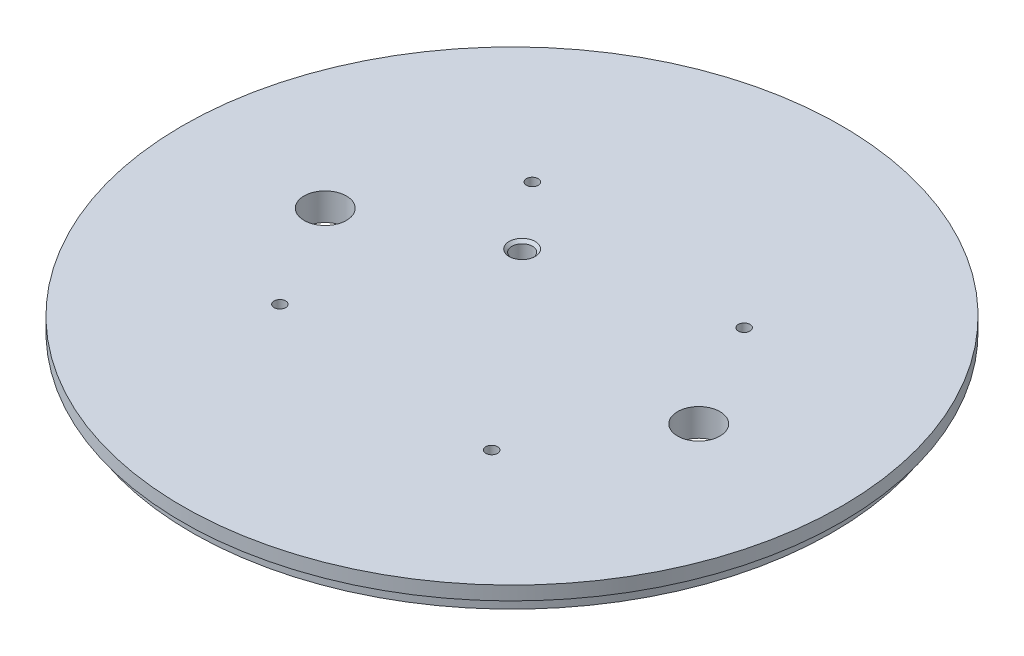
ISO-10303-21;
HEADER;
FILE_DESCRIPTION(('STEP AP214'),'2;1');
FILE_NAME('part.step','',(''),(''),'','','');
FILE_SCHEMA(('AUTOMOTIVE_DESIGN { 1 0 10303 214 1 1 1 1 }'));
ENDSEC;
DATA;
#1=APPLICATION_CONTEXT('core data for automotive mechanical design processes');
#2=APPLICATION_PROTOCOL_DEFINITION('international standard','automotive_design',2000,#1);
#3=PRODUCT_CONTEXT('',#1,'mechanical');
#4=PRODUCT('Part','Part','',(#3));
#5=PRODUCT_RELATED_PRODUCT_CATEGORY('part','',(#4));
#6=PRODUCT_DEFINITION_FORMATION('','',#4);
#7=PRODUCT_DEFINITION_CONTEXT('part definition',#1,'design');
#8=PRODUCT_DEFINITION('design','',#6,#7);
#9=PRODUCT_DEFINITION_SHAPE('','',#8);
#10=(LENGTH_UNIT() NAMED_UNIT(*) SI_UNIT(.MILLI.,.METRE.));
#11=(NAMED_UNIT(*) PLANE_ANGLE_UNIT() SI_UNIT($,.RADIAN.));
#12=(NAMED_UNIT(*) SI_UNIT($,.STERADIAN.) SOLID_ANGLE_UNIT());
#13=UNCERTAINTY_MEASURE_WITH_UNIT(LENGTH_MEASURE(1.E-05),#10,'distance_accuracy_value','');
#14=(GEOMETRIC_REPRESENTATION_CONTEXT(3) GLOBAL_UNCERTAINTY_ASSIGNED_CONTEXT((#13)) GLOBAL_UNIT_ASSIGNED_CONTEXT((#10,
#11,#12)) REPRESENTATION_CONTEXT('',''));
#15=CARTESIAN_POINT('',(0.,0.,0.));
#16=DIRECTION('',(0.,0.,1.));
#17=DIRECTION('',(1.,0.,0.));
#18=AXIS2_PLACEMENT_3D('',#15,#16,#17);
#19=CARTESIAN_POINT('',(0.,0.,0.));
#20=DIRECTION('',(0.,1.,0.));
#21=DIRECTION('',(-0.642787609686541,0.,0.766044443118977));
#22=AXIS2_PLACEMENT_3D('',#19,#20,#21);
#23=PLANE('',#22);
#24=CARTESIAN_POINT('',(2.39391839684799E-13,0.,-34.798));
#25=DIRECTION('',(0.,1.,0.));
#26=DIRECTION('',(0.642787609686535,0.,0.766044443118982));
#27=AXIS2_PLACEMENT_3D('',#24,#25,#26);
#28=CIRCLE('',#27,3.23850000000001);
#29=CARTESIAN_POINT('',(3.23850000000025,0.,-34.798));
#30=VERTEX_POINT('',#29);
#31=CARTESIAN_POINT('',(-3.23849999999977,0.,-34.798));
#32=VERTEX_POINT('',#31);
#33=EDGE_CURVE('E54',#30,#32,#28,.T.);
#34=ORIENTED_EDGE('',*,*,#33,.T.);
#35=DIRECTION('',(0.,0.,1.));
#36=VECTOR('',#35,1.);
#37=CARTESIAN_POINT('',(-3.23850000000008,0.,0.));
#38=LINE('',#37,#36);
#39=CARTESIAN_POINT('',(-3.23849999999996,0.,-13.97));
#40=VERTEX_POINT('',#39);
#41=EDGE_CURVE('E120',#32,#40,#38,.T.);
#42=ORIENTED_EDGE('',*,*,#41,.T.);
#43=CARTESIAN_POINT('',(0.,0.,-13.97));
#44=DIRECTION('',(0.,1.,0.));
#45=DIRECTION('',(0.642787609686535,0.,0.766044443118982));
#46=AXIS2_PLACEMENT_3D('',#43,#44,#45);
#47=CIRCLE('',#46,3.23850000000003);
#48=CARTESIAN_POINT('',(3.23850000000009,0.,-13.97));
#49=VERTEX_POINT('',#48);
#50=EDGE_CURVE('E134',#40,#49,#47,.T.);
#51=ORIENTED_EDGE('',*,*,#50,.T.);
#52=DIRECTION('',(0.,0.,1.));
#53=VECTOR('',#52,1.);
#54=CARTESIAN_POINT('',(3.2385,0.,0.));
#55=LINE('',#54,#53);
#56=EDGE_CURVE('E131',#30,#49,#55,.T.);
#57=ORIENTED_EDGE('',*,*,#56,.F.);
#58=EDGE_LOOP('',(#34,#42,#51,#57));
#59=FACE_BOUND('',#58,.T.);
#60=DIRECTION('',(0.,0.,-1.));
#61=VECTOR('',#60,1.);
#62=CARTESIAN_POINT('',(-3.23850000000008,0.,0.));
#63=LINE('',#62,#61);
#64=CARTESIAN_POINT('',(-3.23850000000001,0.,34.798));
#65=VERTEX_POINT('',#64);
#66=CARTESIAN_POINT('',(-3.23850000000005,0.,13.97));
#67=VERTEX_POINT('',#66);
#68=EDGE_CURVE('E158',#65,#67,#63,.T.);
#69=ORIENTED_EDGE('',*,*,#68,.F.);
#70=CARTESIAN_POINT('',(0.,0.,34.798));
#71=DIRECTION('',(0.,-1.,0.));
#72=DIRECTION('',(0.642787609686541,0.,-0.766044443118977));
#73=AXIS2_PLACEMENT_3D('',#70,#71,#72);
#74=CIRCLE('',#73,3.23850000000001);
#75=CARTESIAN_POINT('',(3.23850000000001,0.,34.798));
#76=VERTEX_POINT('',#75);
#77=EDGE_CURVE('E62',#76,#65,#74,.T.);
#78=ORIENTED_EDGE('',*,*,#77,.F.);
#79=DIRECTION('',(0.,0.,-1.));
#80=VECTOR('',#79,1.);
#81=CARTESIAN_POINT('',(3.2385,0.,0.));
#82=LINE('',#81,#80);
#83=CARTESIAN_POINT('',(3.2385,0.,13.97));
#84=VERTEX_POINT('',#83);
#85=EDGE_CURVE('E148',#76,#84,#82,.T.);
#86=ORIENTED_EDGE('',*,*,#85,.T.);
#87=CARTESIAN_POINT('',(0.,0.,13.97));
#88=DIRECTION('',(0.,-1.,0.));
#89=DIRECTION('',(0.642787609686541,0.,-0.766044443118977));
#90=AXIS2_PLACEMENT_3D('',#87,#88,#89);
#91=CIRCLE('',#90,3.23850000000003);
#92=EDGE_CURVE('E161',#67,#84,#91,.T.);
#93=ORIENTED_EDGE('',*,*,#92,.F.);
#94=EDGE_LOOP('',(#69,#78,#86,#93));
#95=FACE_BOUND('',#94,.T.);
#96=CARTESIAN_POINT('',(-12.2451039645285,0.,-14.5931466414166));
#97=DIRECTION('',(0.,-1.,0.));
#98=DIRECTION('',(0.642787609686541,0.,-0.766044443118977));
#99=AXIS2_PLACEMENT_3D('',#96,#97,#98);
#100=CIRCLE('',#99,3.01625);
#101=CARTESIAN_POINT('',(-10.3062958368115,0.,-16.9037281929742));
#102=VERTEX_POINT('',#101);
#103=EDGE_CURVE('E176',#102,#102,#100,.T.);
#104=ORIENTED_EDGE('',*,*,#103,.F.);
#105=EDGE_LOOP('',(#104));
#106=FACE_BOUND('',#105,.T.);
#107=CARTESIAN_POINT('',(43.18,0.,1.42247325030098E-13));
#108=DIRECTION('',(0.,-1.,0.));
#109=DIRECTION('',(0.642787609686541,0.,-0.766044443118977));
#110=AXIS2_PLACEMENT_3D('',#107,#108,#109);
#111=CIRCLE('',#110,4.9022);
#112=CARTESIAN_POINT('',(46.3310734202054,0.,-3.7553030690577));
#113=VERTEX_POINT('',#112);
#114=EDGE_CURVE('E185',#113,#113,#111,.T.);
#115=ORIENTED_EDGE('',*,*,#114,.F.);
#116=EDGE_LOOP('',(#115));
#117=FACE_BOUND('',#116,.T.);
#118=CARTESIAN_POINT('',(-43.18,0.,-1.42247325030098E-13));
#119=DIRECTION('',(0.,-1.,0.));
#120=DIRECTION('',(0.642787609686541,0.,-0.766044443118977));
#121=AXIS2_PLACEMENT_3D('',#118,#119,#120);
#122=CIRCLE('',#121,4.9022);
#123=CARTESIAN_POINT('',(-40.0289265797946,0.,-3.75530306905799));
#124=VERTEX_POINT('',#123);
#125=EDGE_CURVE('E191',#124,#124,#122,.T.);
#126=ORIENTED_EDGE('',*,*,#125,.F.);
#127=EDGE_LOOP('',(#126));
#128=FACE_BOUND('',#127,.T.);
#129=CARTESIAN_POINT('',(29.1862932828329,0.,-24.4902079290574));
#130=DIRECTION('',(0.,-1.,0.));
#131=DIRECTION('',(0.642787609686541,0.,-0.766044443118977));
#132=AXIS2_PLACEMENT_3D('',#129,#130,#131);
#133=CIRCLE('',#132,1.35255);
#134=CARTESIAN_POINT('',(30.0556956643144,0.,-25.526321340598));
#135=VERTEX_POINT('',#134);
#136=EDGE_CURVE('E197',#135,#135,#133,.T.);
#137=ORIENTED_EDGE('',*,*,#136,.F.);
#138=EDGE_LOOP('',(#137));
#139=FACE_BOUND('',#138,.T.);
#140=CARTESIAN_POINT('',(24.4902079290571,0.,29.1862932828331));
#141=DIRECTION('',(0.,-1.,0.));
#142=DIRECTION('',(0.642787609686541,0.,-0.766044443118977));
#143=AXIS2_PLACEMENT_3D('',#140,#141,#142);
#144=CIRCLE('',#143,1.35255);
#145=CARTESIAN_POINT('',(25.3596103105386,0.,28.1501798712926));
#146=VERTEX_POINT('',#145);
#147=EDGE_CURVE('E203',#146,#146,#144,.T.);
#148=ORIENTED_EDGE('',*,*,#147,.F.);
#149=EDGE_LOOP('',(#148));
#150=FACE_BOUND('',#149,.T.);
#151=CARTESIAN_POINT('',(-24.4902079290571,0.,-29.1862932828331));
#152=DIRECTION('',(0.,-1.,0.));
#153=DIRECTION('',(0.642787609686541,0.,-0.766044443118977));
#154=AXIS2_PLACEMENT_3D('',#151,#152,#153);
#155=CIRCLE('',#154,1.35255);
#156=CARTESIAN_POINT('',(-23.6208055475756,0.,-30.2224066943737));
#157=VERTEX_POINT('',#156);
#158=EDGE_CURVE('E215',#157,#157,#155,.T.);
#159=ORIENTED_EDGE('',*,*,#158,.F.);
#160=EDGE_LOOP('',(#159));
#161=FACE_BOUND('',#160,.T.);
#162=CARTESIAN_POINT('',(-29.186293282833,0.,24.4902079290572));
#163=DIRECTION('',(0.,-1.,0.));
#164=DIRECTION('',(0.642787609686541,0.,-0.766044443118977));
#165=AXIS2_PLACEMENT_3D('',#162,#163,#164);
#166=CIRCLE('',#165,1.35255);
#167=CARTESIAN_POINT('',(-28.3168909013515,0.,23.4540945175166));
#168=VERTEX_POINT('',#167);
#169=EDGE_CURVE('E209',#168,#168,#166,.T.);
#170=ORIENTED_EDGE('',*,*,#169,.F.);
#171=EDGE_LOOP('',(#170));
#172=FACE_BOUND('',#171,.T.);
#173=CARTESIAN_POINT('',(0.,0.,0.));
#174=DIRECTION('',(0.,-1.,0.));
#175=DIRECTION('',(0.642787609686541,0.,-0.766044443118977));
#176=AXIS2_PLACEMENT_3D('',#173,#174,#175);
#177=CIRCLE('',#176,74.041);
#178=CARTESIAN_POINT('',(47.5926374088011,0.,-56.7186966129722));
#179=VERTEX_POINT('',#178);
#180=EDGE_CURVE('E237',#179,#179,#177,.T.);
#181=ORIENTED_EDGE('',*,*,#180,.T.);
#182=EDGE_LOOP('',(#181));
#183=FACE_BOUND('',#182,.T.);
#184=ADVANCED_FACE('F39',(#59,#95,#106,#117,#128,#139,#150,#161,#172,#183),#23,.F.);
#185=CARTESIAN_POINT('',(0.,6.35,0.));
#186=DIRECTION('',(0.,-1.,0.));
#187=DIRECTION('',(0.642787609686541,0.,-0.766044443118977));
#188=AXIS2_PLACEMENT_3D('',#185,#186,#187);
#189=CYLINDRICAL_SURFACE('',#188,76.2);
#190=CARTESIAN_POINT('',(0.,6.35,0.));
#191=DIRECTION('',(0.,1.,0.));
#192=DIRECTION('',(-0.642787609686541,0.,0.766044443118977));
#193=AXIS2_PLACEMENT_3D('',#190,#191,#192);
#194=CIRCLE('',#193,76.2);
#195=CARTESIAN_POINT('',(-48.9804158581144,6.35,58.3725865656661));
#196=VERTEX_POINT('',#195);
#197=EDGE_CURVE('E11',#196,#196,#194,.T.);
#198=ORIENTED_EDGE('',*,*,#197,.F.);
#199=EDGE_LOOP('',(#198));
#200=FACE_BOUND('',#199,.T.);
#201=CARTESIAN_POINT('',(0.,3.175,0.));
#202=DIRECTION('',(0.,-1.,0.));
#203=DIRECTION('',(0.642787609686541,0.,-0.766044443118977));
#204=AXIS2_PLACEMENT_3D('',#201,#202,#203);
#205=CIRCLE('',#204,76.2);
#206=CARTESIAN_POINT('',(48.9804158581144,3.175,-58.3725865656661));
#207=VERTEX_POINT('',#206);
#208=EDGE_CURVE('E132',#207,#207,#205,.T.);
#209=ORIENTED_EDGE('',*,*,#208,.F.);
#210=EDGE_LOOP('',(#209));
#211=FACE_BOUND('',#210,.T.);
#212=ADVANCED_FACE('F41',(#200,#211),#189,.T.);
#213=CARTESIAN_POINT('',(0.,6.35,0.));
#214=DIRECTION('',(0.,1.,0.));
#215=DIRECTION('',(-0.642787609686541,0.,0.766044443118977));
#216=AXIS2_PLACEMENT_3D('',#213,#214,#215);
#217=PLANE('',#216);
#218=CARTESIAN_POINT('',(-12.2451039645285,6.34999999999999,-14.5931466414166));
#219=DIRECTION('',(0.,-1.,0.));
#220=DIRECTION('',(0.642787609686541,0.,-0.766044443118977));
#221=AXIS2_PLACEMENT_3D('',#218,#219,#220);
#222=CIRCLE('',#221,3.01625);
#223=CARTESIAN_POINT('',(-10.3062958368115,6.34999999999999,-16.9037281929742));
#224=VERTEX_POINT('',#223);
#225=EDGE_CURVE('E168',#224,#224,#222,.T.);
#226=ORIENTED_EDGE('',*,*,#225,.T.);
#227=EDGE_LOOP('',(#226));
#228=FACE_BOUND('',#227,.T.);
#229=CARTESIAN_POINT('',(43.18,6.35,1.42247325030098E-13));
#230=DIRECTION('',(0.,-1.,0.));
#231=DIRECTION('',(0.642787609686541,0.,-0.766044443118977));
#232=AXIS2_PLACEMENT_3D('',#229,#230,#231);
#233=CIRCLE('',#232,4.9022);
#234=CARTESIAN_POINT('',(46.3310734202054,6.35,-3.7553030690577));
#235=VERTEX_POINT('',#234);
#236=EDGE_CURVE('E188',#235,#235,#233,.T.);
#237=ORIENTED_EDGE('',*,*,#236,.T.);
#238=EDGE_LOOP('',(#237));
#239=FACE_BOUND('',#238,.T.);
#240=CARTESIAN_POINT('',(-43.18,6.35,-1.42247325030098E-13));
#241=DIRECTION('',(0.,-1.,0.));
#242=DIRECTION('',(0.642787609686541,0.,-0.766044443118977));
#243=AXIS2_PLACEMENT_3D('',#240,#241,#242);
#244=CIRCLE('',#243,4.9022);
#245=CARTESIAN_POINT('',(-40.0289265797946,6.35,-3.75530306905799));
#246=VERTEX_POINT('',#245);
#247=EDGE_CURVE('E194',#246,#246,#244,.T.);
#248=ORIENTED_EDGE('',*,*,#247,.T.);
#249=EDGE_LOOP('',(#248));
#250=FACE_BOUND('',#249,.T.);
#251=CARTESIAN_POINT('',(29.1862932828329,6.35,-24.4902079290574));
#252=DIRECTION('',(0.,-1.,0.));
#253=DIRECTION('',(0.642787609686541,0.,-0.766044443118977));
#254=AXIS2_PLACEMENT_3D('',#251,#252,#253);
#255=CIRCLE('',#254,1.35255);
#256=CARTESIAN_POINT('',(30.0556956643144,6.35,-25.526321340598));
#257=VERTEX_POINT('',#256);
#258=EDGE_CURVE('E200',#257,#257,#255,.T.);
#259=ORIENTED_EDGE('',*,*,#258,.T.);
#260=EDGE_LOOP('',(#259));
#261=FACE_BOUND('',#260,.T.);
#262=CARTESIAN_POINT('',(24.4902079290571,6.35,29.1862932828331));
#263=DIRECTION('',(0.,-1.,0.));
#264=DIRECTION('',(0.642787609686541,0.,-0.766044443118977));
#265=AXIS2_PLACEMENT_3D('',#262,#263,#264);
#266=CIRCLE('',#265,1.35255);
#267=CARTESIAN_POINT('',(25.3596103105386,6.35,28.1501798712926));
#268=VERTEX_POINT('',#267);
#269=EDGE_CURVE('E206',#268,#268,#266,.T.);
#270=ORIENTED_EDGE('',*,*,#269,.T.);
#271=EDGE_LOOP('',(#270));
#272=FACE_BOUND('',#271,.T.);
#273=CARTESIAN_POINT('',(-29.186293282833,6.35,24.4902079290572));
#274=DIRECTION('',(0.,-1.,0.));
#275=DIRECTION('',(0.642787609686541,0.,-0.766044443118977));
#276=AXIS2_PLACEMENT_3D('',#273,#274,#275);
#277=CIRCLE('',#276,1.35255);
#278=CARTESIAN_POINT('',(-28.3168909013515,6.35,23.4540945175166));
#279=VERTEX_POINT('',#278);
#280=EDGE_CURVE('E212',#279,#279,#277,.T.);
#281=ORIENTED_EDGE('',*,*,#280,.T.);
#282=EDGE_LOOP('',(#281));
#283=FACE_BOUND('',#282,.T.);
#284=CARTESIAN_POINT('',(-24.4902079290571,6.35,-29.1862932828331));
#285=DIRECTION('',(0.,-1.,0.));
#286=DIRECTION('',(0.642787609686541,0.,-0.766044443118977));
#287=AXIS2_PLACEMENT_3D('',#284,#285,#286);
#288=CIRCLE('',#287,1.35255);
#289=CARTESIAN_POINT('',(-23.6208055475756,6.35,-30.2224066943737));
#290=VERTEX_POINT('',#289);
#291=EDGE_CURVE('E47',#290,#290,#288,.T.);
#292=ORIENTED_EDGE('',*,*,#291,.T.);
#293=EDGE_LOOP('',(#292));
#294=FACE_BOUND('',#293,.T.);
#295=ORIENTED_EDGE('',*,*,#197,.T.);
#296=EDGE_LOOP('',(#295));
#297=FACE_BOUND('',#296,.T.);
#298=ADVANCED_FACE('F220',(#228,#239,#250,#261,#272,#283,#294,#297),#217,.T.);
#299=CARTESIAN_POINT('',(-24.4902079290571,0.,-29.1862932828331));
#300=DIRECTION('',(0.,-1.,0.));
#301=DIRECTION('',(0.642787609686541,0.,-0.766044443118977));
#302=AXIS2_PLACEMENT_3D('',#299,#300,#301);
#303=CYLINDRICAL_SURFACE('',#302,1.35255);
#304=ORIENTED_EDGE('',*,*,#291,.F.);
#305=EDGE_LOOP('',(#304));
#306=FACE_BOUND('',#305,.T.);
#307=ORIENTED_EDGE('',*,*,#158,.T.);
#308=EDGE_LOOP('',(#307));
#309=FACE_BOUND('',#308,.T.);
#310=ADVANCED_FACE('F223',(#306,#309),#303,.F.);
#311=CARTESIAN_POINT('',(-29.186293282833,0.,24.4902079290572));
#312=DIRECTION('',(0.,-1.,0.));
#313=DIRECTION('',(0.642787609686541,0.,-0.766044443118977));
#314=AXIS2_PLACEMENT_3D('',#311,#312,#313);
#315=CYLINDRICAL_SURFACE('',#314,1.35255);
#316=ORIENTED_EDGE('',*,*,#280,.F.);
#317=EDGE_LOOP('',(#316));
#318=FACE_BOUND('',#317,.T.);
#319=ORIENTED_EDGE('',*,*,#169,.T.);
#320=EDGE_LOOP('',(#319));
#321=FACE_BOUND('',#320,.T.);
#322=ADVANCED_FACE('F226',(#318,#321),#315,.F.);
#323=CARTESIAN_POINT('',(24.4902079290571,0.,29.1862932828331));
#324=DIRECTION('',(0.,-1.,0.));
#325=DIRECTION('',(0.642787609686541,0.,-0.766044443118977));
#326=AXIS2_PLACEMENT_3D('',#323,#324,#325);
#327=CYLINDRICAL_SURFACE('',#326,1.35255);
#328=ORIENTED_EDGE('',*,*,#269,.F.);
#329=EDGE_LOOP('',(#328));
#330=FACE_BOUND('',#329,.T.);
#331=ORIENTED_EDGE('',*,*,#147,.T.);
#332=EDGE_LOOP('',(#331));
#333=FACE_BOUND('',#332,.T.);
#334=ADVANCED_FACE('F262',(#330,#333),#327,.F.);
#335=CARTESIAN_POINT('',(29.1862932828329,0.,-24.4902079290574));
#336=DIRECTION('',(0.,-1.,0.));
#337=DIRECTION('',(0.642787609686541,0.,-0.766044443118977));
#338=AXIS2_PLACEMENT_3D('',#335,#336,#337);
#339=CYLINDRICAL_SURFACE('',#338,1.35255);
#340=ORIENTED_EDGE('',*,*,#258,.F.);
#341=EDGE_LOOP('',(#340));
#342=FACE_BOUND('',#341,.T.);
#343=ORIENTED_EDGE('',*,*,#136,.T.);
#344=EDGE_LOOP('',(#343));
#345=FACE_BOUND('',#344,.T.);
#346=ADVANCED_FACE('F266',(#342,#345),#339,.F.);
#347=CARTESIAN_POINT('',(-43.18,0.,-1.42247325030098E-13));
#348=DIRECTION('',(0.,-1.,0.));
#349=DIRECTION('',(0.642787609686541,0.,-0.766044443118977));
#350=AXIS2_PLACEMENT_3D('',#347,#348,#349);
#351=CYLINDRICAL_SURFACE('',#350,4.9022);
#352=ORIENTED_EDGE('',*,*,#247,.F.);
#353=EDGE_LOOP('',(#352));
#354=FACE_BOUND('',#353,.T.);
#355=ORIENTED_EDGE('',*,*,#125,.T.);
#356=EDGE_LOOP('',(#355));
#357=FACE_BOUND('',#356,.T.);
#358=ADVANCED_FACE('F270',(#354,#357),#351,.F.);
#359=CARTESIAN_POINT('',(43.18,0.,1.42247325030098E-13));
#360=DIRECTION('',(0.,-1.,0.));
#361=DIRECTION('',(0.642787609686541,0.,-0.766044443118977));
#362=AXIS2_PLACEMENT_3D('',#359,#360,#361);
#363=CYLINDRICAL_SURFACE('',#362,4.9022);
#364=ORIENTED_EDGE('',*,*,#236,.F.);
#365=EDGE_LOOP('',(#364));
#366=FACE_BOUND('',#365,.T.);
#367=ORIENTED_EDGE('',*,*,#114,.T.);
#368=EDGE_LOOP('',(#367));
#369=FACE_BOUND('',#368,.T.);
#370=ADVANCED_FACE('F274',(#366,#369),#363,.F.);
#371=CARTESIAN_POINT('',(-12.2451039645285,5.715,-14.5931466414166));
#372=DIRECTION('',(0.,1.,0.));
#373=DIRECTION('',(-0.642787609686541,0.,0.766044443118977));
#374=AXIS2_PLACEMENT_3D('',#371,#372,#373);
#375=CONICAL_SURFACE('',#374,2.38124999999999,0.785398163397459);
#376=ORIENTED_EDGE('',*,*,#225,.F.);
#377=EDGE_LOOP('',(#376));
#378=FACE_BOUND('',#377,.T.);
#379=CARTESIAN_POINT('',(-12.2451039645285,5.715,-14.5931466414166));
#380=DIRECTION('',(0.,-1.,0.));
#381=DIRECTION('',(0.642787609686541,0.,-0.766044443118977));
#382=AXIS2_PLACEMENT_3D('',#379,#380,#381);
#383=CIRCLE('',#382,2.38124999999999);
#384=CARTESIAN_POINT('',(-10.7144659689625,5.715,-16.4172899715936));
#385=VERTEX_POINT('',#384);
#386=EDGE_CURVE('E182',#385,#385,#383,.T.);
#387=ORIENTED_EDGE('',*,*,#386,.T.);
#388=EDGE_LOOP('',(#387));
#389=FACE_BOUND('',#388,.T.);
#390=ADVANCED_FACE('F278',(#378,#389),#375,.F.);
#391=CARTESIAN_POINT('',(-12.2451039645285,0.,-14.5931466414166));
#392=DIRECTION('',(0.,-1.,0.));
#393=DIRECTION('',(0.642787609686541,0.,-0.766044443118977));
#394=AXIS2_PLACEMENT_3D('',#391,#392,#393);
#395=CYLINDRICAL_SURFACE('',#394,2.38124999999999);
#396=ORIENTED_EDGE('',*,*,#386,.F.);
#397=EDGE_LOOP('',(#396));
#398=FACE_BOUND('',#397,.T.);
#399=CARTESIAN_POINT('',(-12.2451039645285,0.635000000000011,-14.5931466414166));
#400=DIRECTION('',(0.,-1.,0.));
#401=DIRECTION('',(0.642787609686541,0.,-0.766044443118977));
#402=AXIS2_PLACEMENT_3D('',#399,#400,#401);
#403=CIRCLE('',#402,2.38124999999999);
#404=CARTESIAN_POINT('',(-10.7144659689625,0.635000000000011,-16.4172899715936));
#405=VERTEX_POINT('',#404);
#406=EDGE_CURVE('E179',#405,#405,#403,.T.);
#407=ORIENTED_EDGE('',*,*,#406,.T.);
#408=EDGE_LOOP('',(#407));
#409=FACE_BOUND('',#408,.T.);
#410=ADVANCED_FACE('F282',(#398,#409),#395,.F.);
#411=CARTESIAN_POINT('',(-12.2451039645285,0.,-14.5931466414166));
#412=DIRECTION('',(0.,-1.,0.));
#413=DIRECTION('',(0.642787609686541,0.,-0.766044443118977));
#414=AXIS2_PLACEMENT_3D('',#411,#412,#413);
#415=CONICAL_SURFACE('',#414,3.01625,0.78539816339745);
#416=ORIENTED_EDGE('',*,*,#406,.F.);
#417=EDGE_LOOP('',(#416));
#418=FACE_BOUND('',#417,.T.);
#419=ORIENTED_EDGE('',*,*,#103,.T.);
#420=EDGE_LOOP('',(#419));
#421=FACE_BOUND('',#420,.T.);
#422=ADVANCED_FACE('F286',(#418,#421),#415,.F.);
#423=CARTESIAN_POINT('',(0.,3.175,34.798));
#424=DIRECTION('',(0.,-1.,0.));
#425=DIRECTION('',(0.642787609686541,0.,-0.766044443118977));
#426=AXIS2_PLACEMENT_3D('',#423,#424,#425);
#427=CYLINDRICAL_SURFACE('',#426,3.23850000000001);
#428=ORIENTED_EDGE('',*,*,#77,.T.);
#429=DIRECTION('',(0.,-1.,0.));
#430=VECTOR('',#429,1.);
#431=CARTESIAN_POINT('',(-3.2385,3.175,34.798));
#432=LINE('',#431,#430);
#433=CARTESIAN_POINT('',(-3.2385,3.175,34.798));
#434=VERTEX_POINT('',#433);
#435=EDGE_CURVE('E156',#434,#65,#432,.T.);
#436=ORIENTED_EDGE('',*,*,#435,.F.);
#437=CARTESIAN_POINT('',(0.,3.175,34.798));
#438=DIRECTION('',(0.,-1.,0.));
#439=DIRECTION('',(0.642787609686541,0.,-0.766044443118977));
#440=AXIS2_PLACEMENT_3D('',#437,#438,#439);
#441=CIRCLE('',#440,3.23850000000001);
#442=CARTESIAN_POINT('',(3.23850000000001,3.175,34.798));
#443=VERTEX_POINT('',#442);
#444=EDGE_CURVE('E144',#443,#434,#441,.T.);
#445=ORIENTED_EDGE('',*,*,#444,.F.);
#446=DIRECTION('',(0.,-1.,0.));
#447=VECTOR('',#446,1.);
#448=CARTESIAN_POINT('',(3.23850000000001,3.175,34.798));
#449=LINE('',#448,#447);
#450=EDGE_CURVE('E166',#443,#76,#449,.T.);
#451=ORIENTED_EDGE('',*,*,#450,.T.);
#452=EDGE_LOOP('',(#428,#436,#445,#451));
#453=FACE_BOUND('',#452,.T.);
#454=ADVANCED_FACE('F290',(#453),#427,.F.);
#455=CARTESIAN_POINT('',(3.2385,3.175,0.));
#456=DIRECTION('',(-1.,0.,0.));
#457=DIRECTION('',(0.,0.,1.));
#458=AXIS2_PLACEMENT_3D('',#455,#456,#457);
#459=PLANE('',#458);
#460=ORIENTED_EDGE('',*,*,#85,.F.);
#461=ORIENTED_EDGE('',*,*,#450,.F.);
#462=DIRECTION('',(0.,0.,-1.));
#463=VECTOR('',#462,1.);
#464=CARTESIAN_POINT('',(3.2385,3.175,0.));
#465=LINE('',#464,#463);
#466=CARTESIAN_POINT('',(3.2385,3.175,13.97));
#467=VERTEX_POINT('',#466);
#468=EDGE_CURVE('E154',#443,#467,#465,.T.);
#469=ORIENTED_EDGE('',*,*,#468,.T.);
#470=DIRECTION('',(0.,-1.,0.));
#471=VECTOR('',#470,1.);
#472=CARTESIAN_POINT('',(3.2385,3.175,13.97));
#473=LINE('',#472,#471);
#474=EDGE_CURVE('E169',#467,#84,#473,.T.);
#475=ORIENTED_EDGE('',*,*,#474,.T.);
#476=EDGE_LOOP('',(#460,#461,#469,#475));
#477=FACE_BOUND('',#476,.T.);
#478=ADVANCED_FACE('F294',(#477),#459,.T.);
#479=CARTESIAN_POINT('',(0.,3.175,13.97));
#480=DIRECTION('',(0.,-1.,0.));
#481=DIRECTION('',(0.642787609686541,0.,-0.766044443118977));
#482=AXIS2_PLACEMENT_3D('',#479,#480,#481);
#483=CYLINDRICAL_SURFACE('',#482,3.23850000000003);
#484=ORIENTED_EDGE('',*,*,#92,.T.);
#485=ORIENTED_EDGE('',*,*,#474,.F.);
#486=CARTESIAN_POINT('',(0.,3.175,13.97));
#487=DIRECTION('',(0.,-1.,0.));
#488=DIRECTION('',(0.642787609686541,0.,-0.766044443118977));
#489=AXIS2_PLACEMENT_3D('',#486,#487,#488);
#490=CIRCLE('',#489,3.23850000000003);
#491=CARTESIAN_POINT('',(-3.23850000000005,3.175,13.97));
#492=VERTEX_POINT('',#491);
#493=EDGE_CURVE('E151',#492,#467,#490,.T.);
#494=ORIENTED_EDGE('',*,*,#493,.F.);
#495=DIRECTION('',(0.,-1.,0.));
#496=VECTOR('',#495,1.);
#497=CARTESIAN_POINT('',(-3.23850000000005,3.175,13.97));
#498=LINE('',#497,#496);
#499=EDGE_CURVE('E171',#492,#67,#498,.T.);
#500=ORIENTED_EDGE('',*,*,#499,.T.);
#501=EDGE_LOOP('',(#484,#485,#494,#500));
#502=FACE_BOUND('',#501,.T.);
#503=ADVANCED_FACE('F299',(#502),#483,.F.);
#504=CARTESIAN_POINT('',(-3.23850000000008,3.175,0.));
#505=DIRECTION('',(-1.,0.,0.));
#506=DIRECTION('',(0.,0.,1.));
#507=AXIS2_PLACEMENT_3D('',#504,#505,#506);
#508=PLANE('',#507);
#509=ORIENTED_EDGE('',*,*,#68,.T.);
#510=ORIENTED_EDGE('',*,*,#499,.F.);
#511=DIRECTION('',(0.,0.,-1.));
#512=VECTOR('',#511,1.);
#513=CARTESIAN_POINT('',(-3.23850000000008,3.175,0.));
#514=LINE('',#513,#512);
#515=EDGE_CURVE('E147',#434,#492,#514,.T.);
#516=ORIENTED_EDGE('',*,*,#515,.F.);
#517=ORIENTED_EDGE('',*,*,#435,.T.);
#518=EDGE_LOOP('',(#509,#510,#516,#517));
#519=FACE_BOUND('',#518,.T.);
#520=ADVANCED_FACE('F295',(#519),#508,.F.);
#521=CARTESIAN_POINT('',(0.,3.175,0.));
#522=DIRECTION('',(0.,-1.,0.));
#523=DIRECTION('',(0.642787609686541,0.,-0.766044443118977));
#524=AXIS2_PLACEMENT_3D('',#521,#522,#523);
#525=PLANE('',#524);
#526=ORIENTED_EDGE('',*,*,#444,.T.);
#527=ORIENTED_EDGE('',*,*,#515,.T.);
#528=ORIENTED_EDGE('',*,*,#493,.T.);
#529=ORIENTED_EDGE('',*,*,#468,.F.);
#530=EDGE_LOOP('',(#526,#527,#528,#529));
#531=FACE_BOUND('',#530,.T.);
#532=ADVANCED_FACE('F298',(#531),#525,.T.);
#533=CARTESIAN_POINT('',(2.39391839684799E-13,3.175,-34.798));
#534=DIRECTION('',(0.,-1.,0.));
#535=DIRECTION('',(0.642787609686541,0.,-0.766044443118977));
#536=AXIS2_PLACEMENT_3D('',#533,#534,#535);
#537=CYLINDRICAL_SURFACE('',#536,3.23850000000001);
#538=ORIENTED_EDGE('',*,*,#33,.F.);
#539=DIRECTION('',(0.,-1.,0.));
#540=VECTOR('',#539,1.);
#541=CARTESIAN_POINT('',(3.23850000000024,3.175,-34.798));
#542=LINE('',#541,#540);
#543=CARTESIAN_POINT('',(3.23850000000024,3.175,-34.798));
#544=VERTEX_POINT('',#543);
#545=EDGE_CURVE('E103',#544,#30,#542,.T.);
#546=ORIENTED_EDGE('',*,*,#545,.F.);
#547=CARTESIAN_POINT('',(2.39391839684799E-13,3.175,-34.798));
#548=DIRECTION('',(0.,1.,0.));
#549=DIRECTION('',(0.642787609686535,0.,0.766044443118982));
#550=AXIS2_PLACEMENT_3D('',#547,#548,#549);
#551=CIRCLE('',#550,3.23850000000001);
#552=CARTESIAN_POINT('',(-3.23849999999977,3.175,-34.798));
#553=VERTEX_POINT('',#552);
#554=EDGE_CURVE('E106',#544,#553,#551,.T.);
#555=ORIENTED_EDGE('',*,*,#554,.T.);
#556=DIRECTION('',(0.,-1.,0.));
#557=VECTOR('',#556,1.);
#558=CARTESIAN_POINT('',(-3.23849999999977,3.175,-34.798));
#559=LINE('',#558,#557);
#560=EDGE_CURVE('E139',#553,#32,#559,.T.);
#561=ORIENTED_EDGE('',*,*,#560,.T.);
#562=EDGE_LOOP('',(#538,#546,#555,#561));
#563=FACE_BOUND('',#562,.T.);
#564=ADVANCED_FACE('F105',(#563),#537,.F.);
#565=CARTESIAN_POINT('',(-3.23850000000008,3.175,0.));
#566=DIRECTION('',(1.,0.,0.));
#567=DIRECTION('',(0.,0.,-1.));
#568=AXIS2_PLACEMENT_3D('',#565,#566,#567);
#569=PLANE('',#568);
#570=ORIENTED_EDGE('',*,*,#41,.F.);
#571=ORIENTED_EDGE('',*,*,#560,.F.);
#572=DIRECTION('',(0.,0.,1.));
#573=VECTOR('',#572,1.);
#574=CARTESIAN_POINT('',(-3.23850000000008,3.175,0.));
#575=LINE('',#574,#573);
#576=CARTESIAN_POINT('',(-3.23849999999996,3.175,-13.97));
#577=VERTEX_POINT('',#576);
#578=EDGE_CURVE('E113',#553,#577,#575,.T.);
#579=ORIENTED_EDGE('',*,*,#578,.T.);
#580=DIRECTION('',(0.,-1.,0.));
#581=VECTOR('',#580,1.);
#582=CARTESIAN_POINT('',(-3.23849999999996,3.175,-13.97));
#583=LINE('',#582,#581);
#584=EDGE_CURVE('E141',#577,#40,#583,.T.);
#585=ORIENTED_EDGE('',*,*,#584,.T.);
#586=EDGE_LOOP('',(#570,#571,#579,#585));
#587=FACE_BOUND('',#586,.T.);
#588=ADVANCED_FACE('F312',(#587),#569,.T.);
#589=CARTESIAN_POINT('',(0.,3.175,-13.97));
#590=DIRECTION('',(0.,-1.,0.));
#591=DIRECTION('',(0.642787609686541,0.,-0.766044443118977));
#592=AXIS2_PLACEMENT_3D('',#589,#590,#591);
#593=CYLINDRICAL_SURFACE('',#592,3.23850000000003);
#594=ORIENTED_EDGE('',*,*,#50,.F.);
#595=ORIENTED_EDGE('',*,*,#584,.F.);
#596=CARTESIAN_POINT('',(0.,3.175,-13.97));
#597=DIRECTION('',(0.,1.,0.));
#598=DIRECTION('',(0.642787609686535,0.,0.766044443118982));
#599=AXIS2_PLACEMENT_3D('',#596,#597,#598);
#600=CIRCLE('',#599,3.23850000000003);
#601=CARTESIAN_POINT('',(3.23850000000009,3.175,-13.97));
#602=VERTEX_POINT('',#601);
#603=EDGE_CURVE('E124',#577,#602,#600,.T.);
#604=ORIENTED_EDGE('',*,*,#603,.T.);
#605=DIRECTION('',(0.,-1.,0.));
#606=VECTOR('',#605,1.);
#607=CARTESIAN_POINT('',(3.23850000000009,3.175,-13.97));
#608=LINE('',#607,#606);
#609=EDGE_CURVE('E112',#602,#49,#608,.T.);
#610=ORIENTED_EDGE('',*,*,#609,.T.);
#611=EDGE_LOOP('',(#594,#595,#604,#610));
#612=FACE_BOUND('',#611,.T.);
#613=ADVANCED_FACE('F315',(#612),#593,.F.);
#614=CARTESIAN_POINT('',(3.2385,3.175,0.));
#615=DIRECTION('',(1.,0.,0.));
#616=DIRECTION('',(0.,0.,-1.));
#617=AXIS2_PLACEMENT_3D('',#614,#615,#616);
#618=PLANE('',#617);
#619=ORIENTED_EDGE('',*,*,#56,.T.);
#620=ORIENTED_EDGE('',*,*,#609,.F.);
#621=DIRECTION('',(0.,0.,1.));
#622=VECTOR('',#621,1.);
#623=CARTESIAN_POINT('',(3.2385,3.175,0.));
#624=LINE('',#623,#622);
#625=EDGE_CURVE('E119',#544,#602,#624,.T.);
#626=ORIENTED_EDGE('',*,*,#625,.F.);
#627=ORIENTED_EDGE('',*,*,#545,.T.);
#628=EDGE_LOOP('',(#619,#620,#626,#627));
#629=FACE_BOUND('',#628,.T.);
#630=ADVANCED_FACE('F123',(#629),#618,.F.);
#631=CARTESIAN_POINT('',(0.,3.175,0.));
#632=DIRECTION('',(0.,-1.,0.));
#633=DIRECTION('',(0.642787609686535,0.,0.766044443118982));
#634=AXIS2_PLACEMENT_3D('',#631,#632,#633);
#635=PLANE('',#634);
#636=ORIENTED_EDGE('',*,*,#554,.F.);
#637=ORIENTED_EDGE('',*,*,#625,.T.);
#638=ORIENTED_EDGE('',*,*,#603,.F.);
#639=ORIENTED_EDGE('',*,*,#578,.F.);
#640=EDGE_LOOP('',(#636,#637,#638,#639));
#641=FACE_BOUND('',#640,.T.);
#642=ADVANCED_FACE('F117',(#641),#635,.T.);
#643=CARTESIAN_POINT('',(0.,3.175,0.));
#644=DIRECTION('',(0.,-1.,0.));
#645=DIRECTION('',(0.642787609686541,0.,-0.766044443118977));
#646=AXIS2_PLACEMENT_3D('',#643,#644,#645);
#647=PLANE('',#646);
#648=CARTESIAN_POINT('',(0.,3.175,0.));
#649=DIRECTION('',(0.,-1.,0.));
#650=DIRECTION('',(0.642787609686541,0.,-0.766044443118977));
#651=AXIS2_PLACEMENT_3D('',#648,#649,#650);
#652=CIRCLE('',#651,74.041);
#653=CARTESIAN_POINT('',(47.5926374088011,3.175,-56.7186966129722));
#654=VERTEX_POINT('',#653);
#655=EDGE_CURVE('E239',#654,#654,#652,.T.);
#656=ORIENTED_EDGE('',*,*,#655,.F.);
#657=EDGE_LOOP('',(#656));
#658=FACE_BOUND('',#657,.T.);
#659=ORIENTED_EDGE('',*,*,#208,.T.);
#660=EDGE_LOOP('',(#659));
#661=FACE_BOUND('',#660,.T.);
#662=ADVANCED_FACE('F246',(#658,#661),#647,.T.);
#663=CARTESIAN_POINT('',(0.,3.175,0.));
#664=DIRECTION('',(0.,-1.,0.));
#665=DIRECTION('',(0.642787609686541,0.,-0.766044443118977));
#666=AXIS2_PLACEMENT_3D('',#663,#664,#665);
#667=CYLINDRICAL_SURFACE('',#666,74.041);
#668=ORIENTED_EDGE('',*,*,#655,.T.);
#669=EDGE_LOOP('',(#668));
#670=FACE_BOUND('',#669,.T.);
#671=ORIENTED_EDGE('',*,*,#180,.F.);
#672=EDGE_LOOP('',(#671));
#673=FACE_BOUND('',#672,.T.);
#674=ADVANCED_FACE('F326',(#670,#673),#667,.T.);
#675=CLOSED_SHELL('',(#184,#212,#298,#310,#322,#334,#346,#358,#370,#390,#410,#422,#454,#478,
#503,#520,#532,#564,#588,#613,#630,#642,#662,#674));
#676=MANIFOLD_SOLID_BREP('B2',#675);
#677=ADVANCED_BREP_SHAPE_REPRESENTATION('',(#18,#676),#14);
#678=SHAPE_DEFINITION_REPRESENTATION(#9,#677);
ENDSEC;
END-ISO-10303-21;
